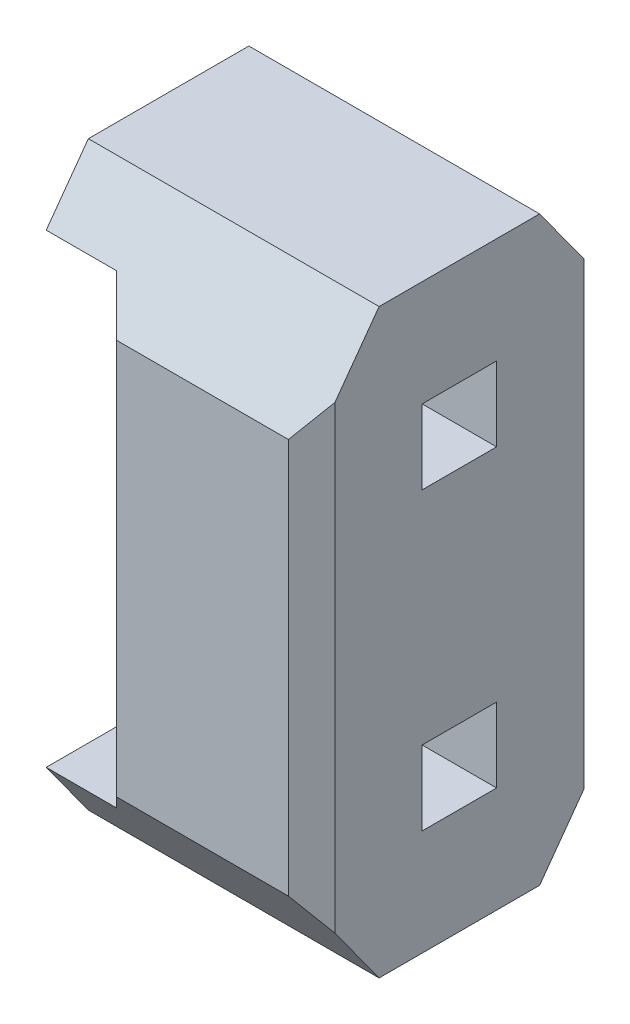
ISO-10303-21;
HEADER;
FILE_DESCRIPTION(('STEP AP214'),'2;1');
FILE_NAME('part.step','',(''),(''),'','','');
FILE_SCHEMA(('AUTOMOTIVE_DESIGN { 1 0 10303 214 1 1 1 1 }'));
ENDSEC;
DATA;
#1=APPLICATION_CONTEXT('core data for automotive mechanical design processes');
#2=APPLICATION_PROTOCOL_DEFINITION('international standard','automotive_design',2000,#1);
#3=PRODUCT_CONTEXT('',#1,'mechanical');
#4=PRODUCT('Part','Part','',(#3));
#5=PRODUCT_RELATED_PRODUCT_CATEGORY('part','',(#4));
#6=PRODUCT_DEFINITION_FORMATION('','',#4);
#7=PRODUCT_DEFINITION_CONTEXT('part definition',#1,'design');
#8=PRODUCT_DEFINITION('design','',#6,#7);
#9=PRODUCT_DEFINITION_SHAPE('','',#8);
#10=(LENGTH_UNIT() NAMED_UNIT(*) SI_UNIT(.MILLI.,.METRE.));
#11=(NAMED_UNIT(*) PLANE_ANGLE_UNIT() SI_UNIT($,.RADIAN.));
#12=(NAMED_UNIT(*) SI_UNIT($,.STERADIAN.) SOLID_ANGLE_UNIT());
#13=UNCERTAINTY_MEASURE_WITH_UNIT(LENGTH_MEASURE(1.E-05),#10,'distance_accuracy_value','');
#14=(GEOMETRIC_REPRESENTATION_CONTEXT(3) GLOBAL_UNCERTAINTY_ASSIGNED_CONTEXT((#13)) GLOBAL_UNIT_ASSIGNED_CONTEXT((#10,
#11,#12)) REPRESENTATION_CONTEXT('',''));
#15=CARTESIAN_POINT('',(0.,0.,0.));
#16=DIRECTION('',(0.,0.,1.));
#17=DIRECTION('',(1.,0.,0.));
#18=AXIS2_PLACEMENT_3D('',#15,#16,#17);
#19=CARTESIAN_POINT('',(1.25,4.6,-7.91));
#20=DIRECTION('',(0.,0.586967571460905,0.809610443394407));
#21=DIRECTION('',(0.,-0.809610443394407,0.586967571460905));
#22=AXIS2_PLACEMENT_3D('',#19,#20,#21);
#23=PLANE('',#22);
#24=DIRECTION('',(1.,0.,0.));
#25=VECTOR('',#24,1.);
#26=CARTESIAN_POINT('',(1.25,4.5,-7.8375));
#27=LINE('',#26,#25);
#28=CARTESIAN_POINT('',(0.,4.5,-7.8375));
#29=VERTEX_POINT('',#28);
#30=CARTESIAN_POINT('',(0.602500000000036,4.5,-7.83750000000004));
#31=VERTEX_POINT('',#30);
#32=EDGE_CURVE('E199',#29,#31,#27,.T.);
#33=ORIENTED_EDGE('',*,*,#32,.T.);
#34=DIRECTION('',(0.506207656349388,-0.698217457033654,0.506207656349365));
#35=VECTOR('',#34,1.);
#36=CARTESIAN_POINT('',(0.6025,4.5,-7.8375));
#37=LINE('',#36,#35);
#38=CARTESIAN_POINT('',(0.819999999999963,4.2,-7.61999999999997));
#39=VERTEX_POINT('',#38);
#40=EDGE_CURVE('E197',#31,#39,#37,.T.);
#41=ORIENTED_EDGE('',*,*,#40,.T.);
#42=DIRECTION('',(1.,0.,0.));
#43=VECTOR('',#42,1.);
#44=CARTESIAN_POINT('',(1.25,4.19999999999999,-7.62000000000001));
#45=LINE('',#44,#43);
#46=CARTESIAN_POINT('',(2.3,4.2,-7.62000000000001));
#47=VERTEX_POINT('',#46);
#48=EDGE_CURVE('E20',#39,#47,#45,.T.);
#49=ORIENTED_EDGE('',*,*,#48,.T.);
#50=DIRECTION('',(0.506207656348956,0.698217457033859,-0.506207656349515));
#51=VECTOR('',#50,1.);
#52=CARTESIAN_POINT('',(2.3,4.19999999999999,-7.62000000000001));
#53=LINE('',#52,#51);
#54=CARTESIAN_POINT('',(2.5,4.47586206896591,-7.82000000000012));
#55=VERTEX_POINT('',#54);
#56=EDGE_CURVE('E181',#47,#55,#53,.T.);
#57=ORIENTED_EDGE('',*,*,#56,.T.);
#58=DIRECTION('',(0.,-0.809610443394407,0.586967571460905));
#59=VECTOR('',#58,1.);
#60=CARTESIAN_POINT('',(2.5,4.6,-7.91));
#61=LINE('',#60,#59);
#62=CARTESIAN_POINT('',(2.5,5.,-8.19999999999999));
#63=VERTEX_POINT('',#62);
#64=EDGE_CURVE('E188',#55,#63,#61,.F.);
#65=ORIENTED_EDGE('',*,*,#64,.T.);
#66=DIRECTION('',(1.,0.,0.));
#67=VECTOR('',#66,1.);
#68=CARTESIAN_POINT('',(1.25,5.,-8.2));
#69=LINE('',#68,#67);
#70=CARTESIAN_POINT('',(0.,5.,-8.19999999999999));
#71=VERTEX_POINT('',#70);
#72=EDGE_CURVE('E215',#71,#63,#69,.T.);
#73=ORIENTED_EDGE('',*,*,#72,.F.);
#74=DIRECTION('',(0.,-0.809610443394407,0.586967571460905));
#75=VECTOR('',#74,1.);
#76=CARTESIAN_POINT('',(0.,4.6,-7.91));
#77=LINE('',#76,#75);
#78=EDGE_CURVE('E207',#71,#29,#77,.T.);
#79=ORIENTED_EDGE('',*,*,#78,.T.);
#80=EDGE_LOOP('',(#33,#41,#49,#57,#65,#73,#79));
#81=FACE_BOUND('',#80,.T.);
#82=ADVANCED_FACE('F17',(#81),#23,.T.);
#83=CARTESIAN_POINT('',(1.25,4.6,-9.87));
#84=DIRECTION('',(0.,-0.586967571460905,0.809610443394407));
#85=DIRECTION('',(0.,-0.809610443394407,-0.586967571460905));
#86=AXIS2_PLACEMENT_3D('',#83,#84,#85);
#87=PLANE('',#86);
#88=DIRECTION('',(0.,-0.809610443394407,-0.586967571460905));
#89=VECTOR('',#88,1.);
#90=CARTESIAN_POINT('',(0.,4.6,-9.87));
#91=LINE('',#90,#89);
#92=CARTESIAN_POINT('',(0.,5.,-9.58000000000001));
#93=VERTEX_POINT('',#92);
#94=CARTESIAN_POINT('',(0.,4.5,-9.9425));
#95=VERTEX_POINT('',#94);
#96=EDGE_CURVE('E263',#93,#95,#91,.T.);
#97=ORIENTED_EDGE('',*,*,#96,.F.);
#98=DIRECTION('',(1.,0.,0.));
#99=VECTOR('',#98,1.);
#100=CARTESIAN_POINT('',(1.25,5.,-9.58));
#101=LINE('',#100,#99);
#102=CARTESIAN_POINT('',(2.5,5.,-9.58));
#103=VERTEX_POINT('',#102);
#104=EDGE_CURVE('E227',#103,#93,#101,.F.);
#105=ORIENTED_EDGE('',*,*,#104,.F.);
#106=DIRECTION('',(0.,-0.809610443394407,-0.586967571460905));
#107=VECTOR('',#106,1.);
#108=CARTESIAN_POINT('',(2.5,4.6,-9.87));
#109=LINE('',#108,#107);
#110=CARTESIAN_POINT('',(2.49999999999994,4.47586206896591,-9.95999999999983));
#111=VERTEX_POINT('',#110);
#112=EDGE_CURVE('E223',#111,#103,#109,.F.);
#113=ORIENTED_EDGE('',*,*,#112,.F.);
#114=DIRECTION('',(0.506207656348956,0.698217457033859,0.506207656349515));
#115=VECTOR('',#114,1.);
#116=CARTESIAN_POINT('',(2.3,4.19999999999999,-10.16));
#117=LINE('',#116,#115);
#118=CARTESIAN_POINT('',(2.30000000000006,4.2,-10.1600000000001));
#119=VERTEX_POINT('',#118);
#120=EDGE_CURVE('E266',#119,#111,#117,.T.);
#121=ORIENTED_EDGE('',*,*,#120,.F.);
#122=DIRECTION('',(1.,0.,0.));
#123=VECTOR('',#122,1.);
#124=CARTESIAN_POINT('',(1.25,4.19999999999999,-10.16));
#125=LINE('',#124,#123);
#126=CARTESIAN_POINT('',(0.819999999999692,4.2,-10.1600000000001));
#127=VERTEX_POINT('',#126);
#128=EDGE_CURVE('E205',#127,#119,#125,.T.);
#129=ORIENTED_EDGE('',*,*,#128,.F.);
#130=DIRECTION('',(0.506207656349042,-0.698217457033819,-0.506207656349485));
#131=VECTOR('',#130,1.);
#132=CARTESIAN_POINT('',(0.6025,4.5,-9.9425));
#133=LINE('',#132,#131);
#134=CARTESIAN_POINT('',(0.602500000000055,4.5,-9.94249999999994));
#135=VERTEX_POINT('',#134);
#136=EDGE_CURVE('E203',#135,#127,#133,.T.);
#137=ORIENTED_EDGE('',*,*,#136,.F.);
#138=DIRECTION('',(1.,0.,0.));
#139=VECTOR('',#138,1.);
#140=CARTESIAN_POINT('',(1.25,4.5,-9.9425));
#141=LINE('',#140,#139);
#142=EDGE_CURVE('E261',#95,#135,#141,.T.);
#143=ORIENTED_EDGE('',*,*,#142,.F.);
#144=EDGE_LOOP('',(#97,#105,#113,#121,#129,#137,#143));
#145=FACE_BOUND('',#144,.T.);
#146=ADVANCED_FACE('F285',(#145),#87,.F.);
#147=CARTESIAN_POINT('',(1.25,0.4,-9.87));
#148=DIRECTION('',(0.,0.586967571460905,0.809610443394407));
#149=DIRECTION('',(0.,-0.809610443394407,0.586967571460905));
#150=AXIS2_PLACEMENT_3D('',#147,#148,#149);
#151=PLANE('',#150);
#152=DIRECTION('',(-0.506207656349403,0.698217457033647,-0.50620765634936));
#153=VECTOR('',#152,1.);
#154=CARTESIAN_POINT('',(2.5,0.524137931034498,-9.96));
#155=LINE('',#154,#153);
#156=CARTESIAN_POINT('',(2.49999999999994,0.524137931034499,-9.95999999999994));
#157=VERTEX_POINT('',#156);
#158=CARTESIAN_POINT('',(2.30000000000006,0.800000000000005,-10.1600000000001));
#159=VERTEX_POINT('',#158);
#160=EDGE_CURVE('E251',#157,#159,#155,.T.);
#161=ORIENTED_EDGE('',*,*,#160,.F.);
#162=DIRECTION('',(0.,-0.809610443394407,0.586967571460905));
#163=VECTOR('',#162,1.);
#164=CARTESIAN_POINT('',(2.5,0.4,-9.87));
#165=LINE('',#164,#163);
#166=CARTESIAN_POINT('',(2.5,0.,-9.58));
#167=VERTEX_POINT('',#166);
#168=EDGE_CURVE('E253',#167,#157,#165,.F.);
#169=ORIENTED_EDGE('',*,*,#168,.F.);
#170=DIRECTION('',(1.,0.,0.));
#171=VECTOR('',#170,1.);
#172=CARTESIAN_POINT('',(1.25,0.,-9.58));
#173=LINE('',#172,#171);
#174=CARTESIAN_POINT('',(0.,0.,-9.58000000000001));
#175=VERTEX_POINT('',#174);
#176=EDGE_CURVE('E288',#167,#175,#173,.F.);
#177=ORIENTED_EDGE('',*,*,#176,.T.);
#178=DIRECTION('',(0.,-0.809610443394407,0.586967571460905));
#179=VECTOR('',#178,1.);
#180=CARTESIAN_POINT('',(0.,0.4,-9.87));
#181=LINE('',#180,#179);
#182=CARTESIAN_POINT('',(0.,0.500000000000002,-9.9425));
#183=VERTEX_POINT('',#182);
#184=EDGE_CURVE('E255',#183,#175,#181,.T.);
#185=ORIENTED_EDGE('',*,*,#184,.F.);
#186=DIRECTION('',(1.,0.,0.));
#187=VECTOR('',#186,1.);
#188=CARTESIAN_POINT('',(1.25,0.500000000000004,-9.9425));
#189=LINE('',#188,#187);
#190=CARTESIAN_POINT('',(0.602500000000056,0.500000000000002,-9.94249999999994));
#191=VERTEX_POINT('',#190);
#192=EDGE_CURVE('E257',#191,#183,#189,.F.);
#193=ORIENTED_EDGE('',*,*,#192,.F.);
#194=DIRECTION('',(-0.506207656349042,-0.698217457033819,0.506207656349485));
#195=VECTOR('',#194,1.);
#196=CARTESIAN_POINT('',(0.8199999999998,0.800000000000011,-10.16));
#197=LINE('',#196,#195);
#198=CARTESIAN_POINT('',(0.819999999999692,0.800000000000005,-10.1600000000001));
#199=VERTEX_POINT('',#198);
#200=EDGE_CURVE('E259',#199,#191,#197,.T.);
#201=ORIENTED_EDGE('',*,*,#200,.F.);
#202=DIRECTION('',(1.,0.,0.));
#203=VECTOR('',#202,1.);
#204=CARTESIAN_POINT('',(1.25,0.800000000000011,-10.16));
#205=LINE('',#204,#203);
#206=EDGE_CURVE('E249',#159,#199,#205,.F.);
#207=ORIENTED_EDGE('',*,*,#206,.F.);
#208=EDGE_LOOP('',(#161,#169,#177,#185,#193,#201,#207));
#209=FACE_BOUND('',#208,.T.);
#210=ADVANCED_FACE('F431',(#209),#151,.F.);
#211=CARTESIAN_POINT('',(1.25,0.4,-7.91));
#212=DIRECTION('',(0.,-0.586967571460905,0.809610443394407));
#213=DIRECTION('',(0.,-0.809610443394407,-0.586967571460905));
#214=AXIS2_PLACEMENT_3D('',#211,#212,#213);
#215=PLANE('',#214);
#216=DIRECTION('',(1.,0.,0.));
#217=VECTOR('',#216,1.);
#218=CARTESIAN_POINT('',(1.25,0.80000000000001,-7.62000000000001));
#219=LINE('',#218,#217);
#220=CARTESIAN_POINT('',(2.3,0.800000000000005,-7.62000000000001));
#221=VERTEX_POINT('',#220);
#222=CARTESIAN_POINT('',(0.819999999999963,0.800000000000005,-7.61999999999997));
#223=VERTEX_POINT('',#222);
#224=EDGE_CURVE('E191',#221,#223,#219,.F.);
#225=ORIENTED_EDGE('',*,*,#224,.T.);
#226=DIRECTION('',(-0.506207656349386,-0.698217457033655,-0.506207656349366));
#227=VECTOR('',#226,1.);
#228=CARTESIAN_POINT('',(0.82,0.80000000000001,-7.62000000000001));
#229=LINE('',#228,#227);
#230=CARTESIAN_POINT('',(0.602500000000036,0.500000000000001,-7.83750000000004));
#231=VERTEX_POINT('',#230);
#232=EDGE_CURVE('E232',#223,#231,#229,.T.);
#233=ORIENTED_EDGE('',*,*,#232,.T.);
#234=DIRECTION('',(1.,0.,0.));
#235=VECTOR('',#234,1.);
#236=CARTESIAN_POINT('',(1.25,0.500000000000002,-7.8375));
#237=LINE('',#236,#235);
#238=CARTESIAN_POINT('',(0.,0.500000000000001,-7.8375));
#239=VERTEX_POINT('',#238);
#240=EDGE_CURVE('E246',#231,#239,#237,.F.);
#241=ORIENTED_EDGE('',*,*,#240,.T.);
#242=DIRECTION('',(0.,-0.809610443394407,-0.586967571460905));
#243=VECTOR('',#242,1.);
#244=CARTESIAN_POINT('',(0.,0.4,-7.91));
#245=LINE('',#244,#243);
#246=CARTESIAN_POINT('',(0.,0.,-8.19999999999999));
#247=VERTEX_POINT('',#246);
#248=EDGE_CURVE('E244',#239,#247,#245,.T.);
#249=ORIENTED_EDGE('',*,*,#248,.T.);
#250=DIRECTION('',(1.,0.,0.));
#251=VECTOR('',#250,1.);
#252=CARTESIAN_POINT('',(1.25,0.,-8.2));
#253=LINE('',#252,#251);
#254=CARTESIAN_POINT('',(2.5,0.,-8.2));
#255=VERTEX_POINT('',#254);
#256=EDGE_CURVE('E293',#247,#255,#253,.T.);
#257=ORIENTED_EDGE('',*,*,#256,.T.);
#258=DIRECTION('',(0.,-0.809610443394407,-0.586967571460905));
#259=VECTOR('',#258,1.);
#260=CARTESIAN_POINT('',(2.5,0.4,-7.91));
#261=LINE('',#260,#259);
#262=CARTESIAN_POINT('',(2.5,0.524137931034498,-7.82));
#263=VERTEX_POINT('',#262);
#264=EDGE_CURVE('E241',#255,#263,#261,.F.);
#265=ORIENTED_EDGE('',*,*,#264,.T.);
#266=DIRECTION('',(-0.506207656349402,0.698217457033647,0.506207656349361));
#267=VECTOR('',#266,1.);
#268=CARTESIAN_POINT('',(2.5,0.524137931034496,-7.82));
#269=LINE('',#268,#267);
#270=EDGE_CURVE('E239',#263,#221,#269,.T.);
#271=ORIENTED_EDGE('',*,*,#270,.T.);
#272=EDGE_LOOP('',(#225,#233,#241,#249,#257,#265,#271));
#273=FACE_BOUND('',#272,.T.);
#274=ADVANCED_FACE('F421',(#273),#215,.T.);
#275=CARTESIAN_POINT('',(1.25,5.,-8.89));
#276=DIRECTION('',(0.,1.,0.));
#277=DIRECTION('',(0.,0.,1.));
#278=AXIS2_PLACEMENT_3D('',#275,#276,#277);
#279=PLANE('',#278);
#280=ORIENTED_EDGE('',*,*,#104,.T.);
#281=DIRECTION('',(0.,0.,-1.));
#282=VECTOR('',#281,1.);
#283=CARTESIAN_POINT('',(0.,5.,-8.89));
#284=LINE('',#283,#282);
#285=EDGE_CURVE('E231',#93,#71,#284,.F.);
#286=ORIENTED_EDGE('',*,*,#285,.T.);
#287=ORIENTED_EDGE('',*,*,#72,.T.);
#288=DIRECTION('',(0.,0.,1.));
#289=VECTOR('',#288,1.);
#290=CARTESIAN_POINT('',(2.5,5.,-8.89));
#291=LINE('',#290,#289);
#292=EDGE_CURVE('E219',#63,#103,#291,.F.);
#293=ORIENTED_EDGE('',*,*,#292,.T.);
#294=EDGE_LOOP('',(#280,#286,#287,#293));
#295=FACE_BOUND('',#294,.T.);
#296=ADVANCED_FACE('F229',(#295),#279,.T.);
#297=CARTESIAN_POINT('',(1.25,0.,-8.89));
#298=DIRECTION('',(0.,1.,0.));
#299=DIRECTION('',(0.,0.,1.));
#300=AXIS2_PLACEMENT_3D('',#297,#298,#299);
#301=PLANE('',#300);
#302=DIRECTION('',(0.,0.,-1.));
#303=VECTOR('',#302,1.);
#304=CARTESIAN_POINT('',(0.,0.,-8.89));
#305=LINE('',#304,#303);
#306=EDGE_CURVE('E297',#247,#175,#305,.T.);
#307=ORIENTED_EDGE('',*,*,#306,.T.);
#308=ORIENTED_EDGE('',*,*,#176,.F.);
#309=DIRECTION('',(0.,0.,1.));
#310=VECTOR('',#309,1.);
#311=CARTESIAN_POINT('',(2.5,0.,-8.89));
#312=LINE('',#311,#310);
#313=EDGE_CURVE('E287',#255,#167,#312,.F.);
#314=ORIENTED_EDGE('',*,*,#313,.F.);
#315=ORIENTED_EDGE('',*,*,#256,.F.);
#316=EDGE_LOOP('',(#307,#308,#314,#315));
#317=FACE_BOUND('',#316,.T.);
#318=ADVANCED_FACE('F428',(#317),#301,.F.);
#319=CARTESIAN_POINT('',(0.,4.75,-8.89));
#320=DIRECTION('',(1.,0.,0.));
#321=DIRECTION('',(0.,0.,-1.));
#322=AXIS2_PLACEMENT_3D('',#319,#320,#321);
#323=PLANE('',#322);
#324=ORIENTED_EDGE('',*,*,#285,.F.);
#325=ORIENTED_EDGE('',*,*,#96,.T.);
#326=DIRECTION('',(0.,0.,1.));
#327=VECTOR('',#326,1.);
#328=CARTESIAN_POINT('',(0.,4.5,-8.89));
#329=LINE('',#328,#327);
#330=EDGE_CURVE('E307',#95,#29,#329,.T.);
#331=ORIENTED_EDGE('',*,*,#330,.T.);
#332=ORIENTED_EDGE('',*,*,#78,.F.);
#333=EDGE_LOOP('',(#324,#325,#331,#332));
#334=FACE_BOUND('',#333,.T.);
#335=ADVANCED_FACE('F441',(#334),#323,.F.);
#336=CARTESIAN_POINT('',(0.,0.25,-8.89));
#337=DIRECTION('',(1.,0.,0.));
#338=DIRECTION('',(0.,0.,-1.));
#339=AXIS2_PLACEMENT_3D('',#336,#337,#338);
#340=PLANE('',#339);
#341=ORIENTED_EDGE('',*,*,#306,.F.);
#342=ORIENTED_EDGE('',*,*,#248,.F.);
#343=DIRECTION('',(0.,0.,1.));
#344=VECTOR('',#343,1.);
#345=CARTESIAN_POINT('',(0.,0.5,-8.89));
#346=LINE('',#345,#344);
#347=EDGE_CURVE('E315',#183,#239,#346,.T.);
#348=ORIENTED_EDGE('',*,*,#347,.F.);
#349=ORIENTED_EDGE('',*,*,#184,.T.);
#350=EDGE_LOOP('',(#341,#342,#348,#349));
#351=FACE_BOUND('',#350,.T.);
#352=ADVANCED_FACE('F443',(#351),#340,.F.);
#353=CARTESIAN_POINT('',(1.55,3.45,-8.89));
#354=DIRECTION('',(0.,1.,0.));
#355=DIRECTION('',(0.,0.,1.));
#356=AXIS2_PLACEMENT_3D('',#353,#354,#355);
#357=PLANE('',#356);
#358=DIRECTION('',(1.,0.,0.));
#359=VECTOR('',#358,1.);
#360=CARTESIAN_POINT('',(1.55,3.45,-9.21));
#361=LINE('',#360,#359);
#362=CARTESIAN_POINT('',(0.6,3.45,-9.21));
#363=VERTEX_POINT('',#362);
#364=CARTESIAN_POINT('',(2.5,3.45,-9.21));
#365=VERTEX_POINT('',#364);
#366=EDGE_CURVE('E332',#363,#365,#361,.T.);
#367=ORIENTED_EDGE('',*,*,#366,.F.);
#368=DIRECTION('',(0.,0.,1.));
#369=VECTOR('',#368,1.);
#370=CARTESIAN_POINT('',(0.6,3.45,-8.89));
#371=LINE('',#370,#369);
#372=CARTESIAN_POINT('',(0.6,3.45,-8.57));
#373=VERTEX_POINT('',#372);
#374=EDGE_CURVE('E302',#363,#373,#371,.T.);
#375=ORIENTED_EDGE('',*,*,#374,.T.);
#376=DIRECTION('',(1.,0.,0.));
#377=VECTOR('',#376,1.);
#378=CARTESIAN_POINT('',(1.55,3.45,-8.57));
#379=LINE('',#378,#377);
#380=CARTESIAN_POINT('',(2.5,3.45,-8.57));
#381=VERTEX_POINT('',#380);
#382=EDGE_CURVE('E327',#373,#381,#379,.T.);
#383=ORIENTED_EDGE('',*,*,#382,.T.);
#384=DIRECTION('',(0.,0.,1.));
#385=VECTOR('',#384,1.);
#386=CARTESIAN_POINT('',(2.5,3.45,-8.89));
#387=LINE('',#386,#385);
#388=EDGE_CURVE('E300',#381,#365,#387,.F.);
#389=ORIENTED_EDGE('',*,*,#388,.T.);
#390=EDGE_LOOP('',(#367,#375,#383,#389));
#391=FACE_BOUND('',#390,.T.);
#392=ADVANCED_FACE('F398',(#391),#357,.T.);
#393=CARTESIAN_POINT('',(0.7099999999997,2.5,-10.05));
#394=DIRECTION('',(0.707106781188998,0.,0.707106781184098));
#395=DIRECTION('',(0.707106781184098,0.,-0.707106781188998));
#396=AXIS2_PLACEMENT_3D('',#393,#394,#395);
#397=PLANE('',#396);
#398=ORIENTED_EDGE('',*,*,#200,.T.);
#399=DIRECTION('',(0.70710678118621,0.,-0.707106781186885));
#400=VECTOR('',#399,1.);
#401=CARTESIAN_POINT('',(0.6,0.5,-9.94));
#402=LINE('',#401,#400);
#403=CARTESIAN_POINT('',(0.600000000000115,0.5,-9.93999999999988));
#404=VERTEX_POINT('',#403);
#405=EDGE_CURVE('E312',#404,#191,#402,.T.);
#406=ORIENTED_EDGE('',*,*,#405,.F.);
#407=DIRECTION('',(0.,1.,0.));
#408=VECTOR('',#407,1.);
#409=CARTESIAN_POINT('',(0.6,2.5,-9.94));
#410=LINE('',#409,#408);
#411=CARTESIAN_POINT('',(0.600000000000115,4.5,-9.93999999999988));
#412=VERTEX_POINT('',#411);
#413=EDGE_CURVE('E337',#404,#412,#410,.T.);
#414=ORIENTED_EDGE('',*,*,#413,.T.);
#415=DIRECTION('',(0.70710678118621,0.,-0.707106781186885));
#416=VECTOR('',#415,1.);
#417=CARTESIAN_POINT('',(0.6,4.5,-9.94));
#418=LINE('',#417,#416);
#419=EDGE_CURVE('E304',#412,#135,#418,.T.);
#420=ORIENTED_EDGE('',*,*,#419,.T.);
#421=ORIENTED_EDGE('',*,*,#136,.T.);
#422=DIRECTION('',(0.,1.,0.));
#423=VECTOR('',#422,1.);
#424=CARTESIAN_POINT('',(0.8199999999998,2.5,-10.16));
#425=LINE('',#424,#423);
#426=EDGE_CURVE('E275',#127,#199,#425,.F.);
#427=ORIENTED_EDGE('',*,*,#426,.T.);
#428=EDGE_LOOP('',(#398,#406,#414,#420,#421,#427));
#429=FACE_BOUND('',#428,.T.);
#430=ADVANCED_FACE('F435',(#429),#397,.F.);
#431=CARTESIAN_POINT('',(0.30125,4.5,-8.89));
#432=DIRECTION('',(0.,1.,0.));
#433=DIRECTION('',(0.,0.,1.));
#434=AXIS2_PLACEMENT_3D('',#431,#432,#433);
#435=PLANE('',#434);
#436=ORIENTED_EDGE('',*,*,#142,.T.);
#437=ORIENTED_EDGE('',*,*,#419,.F.);
#438=DIRECTION('',(0.,0.,-1.));
#439=VECTOR('',#438,1.);
#440=CARTESIAN_POINT('',(0.6,4.5,-8.89));
#441=LINE('',#440,#439);
#442=CARTESIAN_POINT('',(0.600000000000037,4.5,-7.84000000000004));
#443=VERTEX_POINT('',#442);
#444=EDGE_CURVE('E339',#412,#443,#441,.F.);
#445=ORIENTED_EDGE('',*,*,#444,.T.);
#446=DIRECTION('',(-0.707106781185598,0.,-0.707106781187498));
#447=VECTOR('',#446,1.);
#448=CARTESIAN_POINT('',(0.71,4.5,-7.73));
#449=LINE('',#448,#447);
#450=EDGE_CURVE('E310',#443,#31,#449,.F.);
#451=ORIENTED_EDGE('',*,*,#450,.T.);
#452=ORIENTED_EDGE('',*,*,#32,.F.);
#453=ORIENTED_EDGE('',*,*,#330,.F.);
#454=EDGE_LOOP('',(#436,#437,#445,#451,#452,#453));
#455=FACE_BOUND('',#454,.T.);
#456=ADVANCED_FACE('F439',(#455),#435,.F.);
#457=CARTESIAN_POINT('',(0.71,2.5,-7.73));
#458=DIRECTION('',(0.707106781187498,0.,-0.707106781185598));
#459=DIRECTION('',(-0.707106781185598,0.,-0.707106781187498));
#460=AXIS2_PLACEMENT_3D('',#457,#458,#459);
#461=PLANE('',#460);
#462=ORIENTED_EDGE('',*,*,#232,.F.);
#463=DIRECTION('',(0.,1.,0.));
#464=VECTOR('',#463,1.);
#465=CARTESIAN_POINT('',(0.82,2.5,-7.62));
#466=LINE('',#465,#464);
#467=EDGE_CURVE('E325',#39,#223,#466,.F.);
#468=ORIENTED_EDGE('',*,*,#467,.F.);
#469=ORIENTED_EDGE('',*,*,#40,.F.);
#470=ORIENTED_EDGE('',*,*,#450,.F.);
#471=DIRECTION('',(0.,1.,0.));
#472=VECTOR('',#471,1.);
#473=CARTESIAN_POINT('',(0.6,2.5,-7.84));
#474=LINE('',#473,#472);
#475=CARTESIAN_POINT('',(0.600000000000074,0.5,-7.84000000000007));
#476=VERTEX_POINT('',#475);
#477=EDGE_CURVE('E341',#443,#476,#474,.F.);
#478=ORIENTED_EDGE('',*,*,#477,.T.);
#479=DIRECTION('',(-0.707106781186701,0.,-0.707106781186394));
#480=VECTOR('',#479,1.);
#481=CARTESIAN_POINT('',(0.6025,0.5,-7.8375));
#482=LINE('',#481,#480);
#483=EDGE_CURVE('E318',#231,#476,#482,.T.);
#484=ORIENTED_EDGE('',*,*,#483,.F.);
#485=EDGE_LOOP('',(#462,#468,#469,#470,#478,#484));
#486=FACE_BOUND('',#485,.T.);
#487=ADVANCED_FACE('F416',(#486),#461,.F.);
#488=CARTESIAN_POINT('',(0.30125,0.5,-8.89));
#489=DIRECTION('',(0.,1.,0.));
#490=DIRECTION('',(0.,0.,1.));
#491=AXIS2_PLACEMENT_3D('',#488,#489,#490);
#492=PLANE('',#491);
#493=ORIENTED_EDGE('',*,*,#483,.T.);
#494=DIRECTION('',(0.,0.,-1.));
#495=VECTOR('',#494,1.);
#496=CARTESIAN_POINT('',(0.6,0.5,-8.89));
#497=LINE('',#496,#495);
#498=EDGE_CURVE('E343',#476,#404,#497,.T.);
#499=ORIENTED_EDGE('',*,*,#498,.T.);
#500=ORIENTED_EDGE('',*,*,#405,.T.);
#501=ORIENTED_EDGE('',*,*,#192,.T.);
#502=ORIENTED_EDGE('',*,*,#347,.T.);
#503=ORIENTED_EDGE('',*,*,#240,.F.);
#504=EDGE_LOOP('',(#493,#499,#500,#501,#502,#503));
#505=FACE_BOUND('',#504,.T.);
#506=ADVANCED_FACE('F418',(#505),#492,.T.);
#507=CARTESIAN_POINT('',(1.55,1.23,-9.21));
#508=DIRECTION('',(0.,0.,1.));
#509=DIRECTION('',(1.,0.,0.));
#510=AXIS2_PLACEMENT_3D('',#507,#508,#509);
#511=PLANE('',#510);
#512=DIRECTION('',(1.,0.,0.));
#513=VECTOR('',#512,1.);
#514=CARTESIAN_POINT('',(1.55,1.55,-9.21));
#515=LINE('',#514,#513);
#516=CARTESIAN_POINT('',(2.5,1.55,-9.21));
#517=VERTEX_POINT('',#516);
#518=CARTESIAN_POINT('',(0.6,1.55,-9.21));
#519=VERTEX_POINT('',#518);
#520=EDGE_CURVE('E283',#517,#519,#515,.F.);
#521=ORIENTED_EDGE('',*,*,#520,.T.);
#522=DIRECTION('',(0.,1.,0.));
#523=VECTOR('',#522,1.);
#524=CARTESIAN_POINT('',(0.6,2.5,-9.21));
#525=LINE('',#524,#523);
#526=CARTESIAN_POINT('',(0.6,0.91,-9.21));
#527=VERTEX_POINT('',#526);
#528=EDGE_CURVE('E346',#519,#527,#525,.F.);
#529=ORIENTED_EDGE('',*,*,#528,.T.);
#530=DIRECTION('',(1.,0.,0.));
#531=VECTOR('',#530,1.);
#532=CARTESIAN_POINT('',(1.55,0.91,-9.21));
#533=LINE('',#532,#531);
#534=CARTESIAN_POINT('',(2.5,0.91,-9.21));
#535=VERTEX_POINT('',#534);
#536=EDGE_CURVE('E354',#535,#527,#533,.F.);
#537=ORIENTED_EDGE('',*,*,#536,.F.);
#538=DIRECTION('',(0.,1.,0.));
#539=VECTOR('',#538,1.);
#540=CARTESIAN_POINT('',(2.5,1.23,-9.21));
#541=LINE('',#540,#539);
#542=EDGE_CURVE('E321',#535,#517,#541,.T.);
#543=ORIENTED_EDGE('',*,*,#542,.T.);
#544=EDGE_LOOP('',(#521,#529,#537,#543));
#545=FACE_BOUND('',#544,.T.);
#546=ADVANCED_FACE('F483',(#545),#511,.T.);
#547=CARTESIAN_POINT('',(1.56,2.5,-10.16));
#548=DIRECTION('',(0.,0.,1.));
#549=DIRECTION('',(1.,0.,0.));
#550=AXIS2_PLACEMENT_3D('',#547,#548,#549);
#551=PLANE('',#550);
#552=DIRECTION('',(0.,1.,0.));
#553=VECTOR('',#552,1.);
#554=CARTESIAN_POINT('',(2.30000000000023,2.5,-10.1600000000002));
#555=LINE('',#554,#553);
#556=EDGE_CURVE('E193',#159,#119,#555,.T.);
#557=ORIENTED_EDGE('',*,*,#556,.F.);
#558=ORIENTED_EDGE('',*,*,#206,.T.);
#559=ORIENTED_EDGE('',*,*,#426,.F.);
#560=ORIENTED_EDGE('',*,*,#128,.T.);
#561=EDGE_LOOP('',(#557,#558,#559,#560));
#562=FACE_BOUND('',#561,.T.);
#563=ADVANCED_FACE('F272',(#562),#551,.F.);
#564=CARTESIAN_POINT('',(1.56,2.5,-7.62));
#565=DIRECTION('',(0.,0.,1.));
#566=DIRECTION('',(1.,0.,0.));
#567=AXIS2_PLACEMENT_3D('',#564,#565,#566);
#568=PLANE('',#567);
#569=ORIENTED_EDGE('',*,*,#48,.F.);
#570=ORIENTED_EDGE('',*,*,#467,.T.);
#571=ORIENTED_EDGE('',*,*,#224,.F.);
#572=DIRECTION('',(0.,1.,0.));
#573=VECTOR('',#572,1.);
#574=CARTESIAN_POINT('',(2.3,2.5,-7.62));
#575=LINE('',#574,#573);
#576=EDGE_CURVE('E183',#47,#221,#575,.F.);
#577=ORIENTED_EDGE('',*,*,#576,.F.);
#578=EDGE_LOOP('',(#569,#570,#571,#577));
#579=FACE_BOUND('',#578,.T.);
#580=ADVANCED_FACE('F189',(#579),#568,.T.);
#581=CARTESIAN_POINT('',(1.55,3.77,-8.57));
#582=DIRECTION('',(0.,0.,1.));
#583=DIRECTION('',(1.,0.,0.));
#584=AXIS2_PLACEMENT_3D('',#581,#582,#583);
#585=PLANE('',#584);
#586=DIRECTION('',(0.,1.,0.));
#587=VECTOR('',#586,1.);
#588=CARTESIAN_POINT('',(2.5,3.77,-8.57));
#589=LINE('',#588,#587);
#590=CARTESIAN_POINT('',(2.5,4.09,-8.57));
#591=VERTEX_POINT('',#590);
#592=EDGE_CURVE('E330',#381,#591,#589,.T.);
#593=ORIENTED_EDGE('',*,*,#592,.F.);
#594=ORIENTED_EDGE('',*,*,#382,.F.);
#595=DIRECTION('',(0.,1.,0.));
#596=VECTOR('',#595,1.);
#597=CARTESIAN_POINT('',(0.6,2.5,-8.57));
#598=LINE('',#597,#596);
#599=CARTESIAN_POINT('',(0.6,4.09,-8.57));
#600=VERTEX_POINT('',#599);
#601=EDGE_CURVE('E351',#373,#600,#598,.T.);
#602=ORIENTED_EDGE('',*,*,#601,.T.);
#603=DIRECTION('',(1.,0.,0.));
#604=VECTOR('',#603,1.);
#605=CARTESIAN_POINT('',(1.55,4.09,-8.57));
#606=LINE('',#605,#604);
#607=EDGE_CURVE('E368',#600,#591,#606,.T.);
#608=ORIENTED_EDGE('',*,*,#607,.T.);
#609=EDGE_LOOP('',(#593,#594,#602,#608));
#610=FACE_BOUND('',#609,.T.);
#611=ADVANCED_FACE('F402',(#610),#585,.F.);
#612=CARTESIAN_POINT('',(1.55,3.77,-9.21));
#613=DIRECTION('',(0.,0.,1.));
#614=DIRECTION('',(1.,0.,0.));
#615=AXIS2_PLACEMENT_3D('',#612,#613,#614);
#616=PLANE('',#615);
#617=DIRECTION('',(1.,0.,0.));
#618=VECTOR('',#617,1.);
#619=CARTESIAN_POINT('',(1.55,4.09,-9.21));
#620=LINE('',#619,#618);
#621=CARTESIAN_POINT('',(2.5,4.09,-9.21));
#622=VERTEX_POINT('',#621);
#623=CARTESIAN_POINT('',(0.6,4.09,-9.21));
#624=VERTEX_POINT('',#623);
#625=EDGE_CURVE('E371',#622,#624,#620,.F.);
#626=ORIENTED_EDGE('',*,*,#625,.T.);
#627=DIRECTION('',(0.,1.,0.));
#628=VECTOR('',#627,1.);
#629=CARTESIAN_POINT('',(0.6,2.5,-9.21));
#630=LINE('',#629,#628);
#631=EDGE_CURVE('E348',#624,#363,#630,.F.);
#632=ORIENTED_EDGE('',*,*,#631,.T.);
#633=ORIENTED_EDGE('',*,*,#366,.T.);
#634=DIRECTION('',(0.,1.,0.));
#635=VECTOR('',#634,1.);
#636=CARTESIAN_POINT('',(2.5,3.77,-9.21));
#637=LINE('',#636,#635);
#638=EDGE_CURVE('E335',#365,#622,#637,.T.);
#639=ORIENTED_EDGE('',*,*,#638,.T.);
#640=EDGE_LOOP('',(#626,#632,#633,#639));
#641=FACE_BOUND('',#640,.T.);
#642=ADVANCED_FACE('F395',(#641),#616,.T.);
#643=CARTESIAN_POINT('',(0.6,2.5,-8.89));
#644=DIRECTION('',(1.,0.,0.));
#645=DIRECTION('',(0.,0.,-1.));
#646=AXIS2_PLACEMENT_3D('',#643,#644,#645);
#647=PLANE('',#646);
#648=ORIENTED_EDGE('',*,*,#374,.F.);
#649=ORIENTED_EDGE('',*,*,#631,.F.);
#650=DIRECTION('',(0.,0.,1.));
#651=VECTOR('',#650,1.);
#652=CARTESIAN_POINT('',(0.6,4.09,-8.89));
#653=LINE('',#652,#651);
#654=EDGE_CURVE('E192',#624,#600,#653,.T.);
#655=ORIENTED_EDGE('',*,*,#654,.T.);
#656=ORIENTED_EDGE('',*,*,#601,.F.);
#657=EDGE_LOOP('',(#648,#649,#655,#656));
#658=FACE_BOUND('',#657,.T.);
#659=ORIENTED_EDGE('',*,*,#528,.F.);
#660=DIRECTION('',(0.,0.,1.));
#661=VECTOR('',#660,1.);
#662=CARTESIAN_POINT('',(0.6,1.55,-8.89));
#663=LINE('',#662,#661);
#664=CARTESIAN_POINT('',(0.6,1.55,-8.57));
#665=VERTEX_POINT('',#664);
#666=EDGE_CURVE('E360',#519,#665,#663,.T.);
#667=ORIENTED_EDGE('',*,*,#666,.T.);
#668=DIRECTION('',(0.,1.,0.));
#669=VECTOR('',#668,1.);
#670=CARTESIAN_POINT('',(0.6,1.23,-8.57));
#671=LINE('',#670,#669);
#672=CARTESIAN_POINT('',(0.6,0.91,-8.57));
#673=VERTEX_POINT('',#672);
#674=EDGE_CURVE('E374',#665,#673,#671,.F.);
#675=ORIENTED_EDGE('',*,*,#674,.T.);
#676=DIRECTION('',(0.,0.,1.));
#677=VECTOR('',#676,1.);
#678=CARTESIAN_POINT('',(0.6,0.91,-8.89));
#679=LINE('',#678,#677);
#680=EDGE_CURVE('E357',#527,#673,#679,.T.);
#681=ORIENTED_EDGE('',*,*,#680,.F.);
#682=EDGE_LOOP('',(#659,#667,#675,#681));
#683=FACE_BOUND('',#682,.T.);
#684=ORIENTED_EDGE('',*,*,#477,.F.);
#685=ORIENTED_EDGE('',*,*,#444,.F.);
#686=ORIENTED_EDGE('',*,*,#413,.F.);
#687=ORIENTED_EDGE('',*,*,#498,.F.);
#688=EDGE_LOOP('',(#684,#685,#686,#687));
#689=FACE_BOUND('',#688,.T.);
#690=ADVANCED_FACE('F404',(#658,#683,#689),#647,.F.);
#691=CARTESIAN_POINT('',(1.55,0.91,-8.89));
#692=DIRECTION('',(0.,1.,0.));
#693=DIRECTION('',(0.,0.,1.));
#694=AXIS2_PLACEMENT_3D('',#691,#692,#693);
#695=PLANE('',#694);
#696=ORIENTED_EDGE('',*,*,#536,.T.);
#697=ORIENTED_EDGE('',*,*,#680,.T.);
#698=DIRECTION('',(1.,0.,0.));
#699=VECTOR('',#698,1.);
#700=CARTESIAN_POINT('',(1.55,0.91,-8.57));
#701=LINE('',#700,#699);
#702=CARTESIAN_POINT('',(2.5,0.91,-8.57));
#703=VERTEX_POINT('',#702);
#704=EDGE_CURVE('E376',#673,#703,#701,.T.);
#705=ORIENTED_EDGE('',*,*,#704,.T.);
#706=DIRECTION('',(0.,0.,1.));
#707=VECTOR('',#706,1.);
#708=CARTESIAN_POINT('',(2.5,0.91,-8.89));
#709=LINE('',#708,#707);
#710=EDGE_CURVE('E34',#703,#535,#709,.F.);
#711=ORIENTED_EDGE('',*,*,#710,.T.);
#712=EDGE_LOOP('',(#696,#697,#705,#711));
#713=FACE_BOUND('',#712,.T.);
#714=ADVANCED_FACE('F407',(#713),#695,.T.);
#715=CARTESIAN_POINT('',(1.55,1.55,-8.89));
#716=DIRECTION('',(0.,1.,0.));
#717=DIRECTION('',(0.,0.,1.));
#718=AXIS2_PLACEMENT_3D('',#715,#716,#717);
#719=PLANE('',#718);
#720=DIRECTION('',(0.,0.,1.));
#721=VECTOR('',#720,1.);
#722=CARTESIAN_POINT('',(2.5,1.55,-8.89));
#723=LINE('',#722,#721);
#724=CARTESIAN_POINT('',(2.5,1.55,-8.57));
#725=VERTEX_POINT('',#724);
#726=EDGE_CURVE('E362',#725,#517,#723,.F.);
#727=ORIENTED_EDGE('',*,*,#726,.F.);
#728=DIRECTION('',(1.,0.,0.));
#729=VECTOR('',#728,1.);
#730=CARTESIAN_POINT('',(1.55,1.55,-8.57));
#731=LINE('',#730,#729);
#732=EDGE_CURVE('E378',#725,#665,#731,.F.);
#733=ORIENTED_EDGE('',*,*,#732,.T.);
#734=ORIENTED_EDGE('',*,*,#666,.F.);
#735=ORIENTED_EDGE('',*,*,#520,.F.);
#736=EDGE_LOOP('',(#727,#733,#734,#735));
#737=FACE_BOUND('',#736,.T.);
#738=ADVANCED_FACE('F468',(#737),#719,.F.);
#739=CARTESIAN_POINT('',(2.4,2.5,-10.06));
#740=DIRECTION('',(0.707106781188198,0.,-0.707106781184898));
#741=DIRECTION('',(-0.707106781184898,0.,-0.707106781188198));
#742=AXIS2_PLACEMENT_3D('',#739,#740,#741);
#743=PLANE('',#742);
#744=DIRECTION('',(0.,1.,0.));
#745=VECTOR('',#744,1.);
#746=CARTESIAN_POINT('',(2.5,2.5,-9.96));
#747=LINE('',#746,#745);
#748=EDGE_CURVE('E381',#157,#111,#747,.T.);
#749=ORIENTED_EDGE('',*,*,#748,.F.);
#750=ORIENTED_EDGE('',*,*,#160,.T.);
#751=ORIENTED_EDGE('',*,*,#556,.T.);
#752=ORIENTED_EDGE('',*,*,#120,.T.);
#753=EDGE_LOOP('',(#749,#750,#751,#752));
#754=FACE_BOUND('',#753,.T.);
#755=ADVANCED_FACE('F281',(#754),#743,.T.);
#756=CARTESIAN_POINT('',(2.4,2.5,-7.72));
#757=DIRECTION('',(0.707106781186548,0.,0.707106781186548));
#758=DIRECTION('',(0.707106781186548,0.,-0.707106781186548));
#759=AXIS2_PLACEMENT_3D('',#756,#757,#758);
#760=PLANE('',#759);
#761=DIRECTION('',(0.,1.,0.));
#762=VECTOR('',#761,1.);
#763=CARTESIAN_POINT('',(2.5,2.5,-7.82));
#764=LINE('',#763,#762);
#765=EDGE_CURVE('E186',#55,#263,#764,.F.);
#766=ORIENTED_EDGE('',*,*,#765,.F.);
#767=ORIENTED_EDGE('',*,*,#56,.F.);
#768=ORIENTED_EDGE('',*,*,#576,.T.);
#769=ORIENTED_EDGE('',*,*,#270,.F.);
#770=EDGE_LOOP('',(#766,#767,#768,#769));
#771=FACE_BOUND('',#770,.T.);
#772=ADVANCED_FACE('F182',(#771),#760,.T.);
#773=CARTESIAN_POINT('',(1.55,4.09,-8.89));
#774=DIRECTION('',(0.,1.,0.));
#775=DIRECTION('',(0.,0.,1.));
#776=AXIS2_PLACEMENT_3D('',#773,#774,#775);
#777=PLANE('',#776);
#778=DIRECTION('',(0.,0.,-1.));
#779=VECTOR('',#778,1.);
#780=CARTESIAN_POINT('',(2.5,4.09,-8.89));
#781=LINE('',#780,#779);
#782=EDGE_CURVE('E26',#591,#622,#781,.T.);
#783=ORIENTED_EDGE('',*,*,#782,.F.);
#784=ORIENTED_EDGE('',*,*,#607,.F.);
#785=ORIENTED_EDGE('',*,*,#654,.F.);
#786=ORIENTED_EDGE('',*,*,#625,.F.);
#787=EDGE_LOOP('',(#783,#784,#785,#786));
#788=FACE_BOUND('',#787,.T.);
#789=ADVANCED_FACE('F392',(#788),#777,.F.);
#790=CARTESIAN_POINT('',(1.55,1.23,-8.57));
#791=DIRECTION('',(0.,0.,1.));
#792=DIRECTION('',(1.,0.,0.));
#793=AXIS2_PLACEMENT_3D('',#790,#791,#792);
#794=PLANE('',#793);
#795=DIRECTION('',(0.,1.,0.));
#796=VECTOR('',#795,1.);
#797=CARTESIAN_POINT('',(2.5,2.5,-8.57));
#798=LINE('',#797,#796);
#799=EDGE_CURVE('E11',#703,#725,#798,.T.);
#800=ORIENTED_EDGE('',*,*,#799,.F.);
#801=ORIENTED_EDGE('',*,*,#704,.F.);
#802=ORIENTED_EDGE('',*,*,#674,.F.);
#803=ORIENTED_EDGE('',*,*,#732,.F.);
#804=EDGE_LOOP('',(#800,#801,#802,#803));
#805=FACE_BOUND('',#804,.T.);
#806=ADVANCED_FACE('F454',(#805),#794,.F.);
#807=CARTESIAN_POINT('',(2.5,2.5,-8.89));
#808=DIRECTION('',(1.,0.,0.));
#809=DIRECTION('',(0.,0.,-1.));
#810=AXIS2_PLACEMENT_3D('',#807,#808,#809);
#811=PLANE('',#810);
#812=ORIENTED_EDGE('',*,*,#710,.F.);
#813=ORIENTED_EDGE('',*,*,#799,.T.);
#814=ORIENTED_EDGE('',*,*,#726,.T.);
#815=ORIENTED_EDGE('',*,*,#542,.F.);
#816=EDGE_LOOP('',(#812,#813,#814,#815));
#817=FACE_BOUND('',#816,.T.);
#818=ORIENTED_EDGE('',*,*,#592,.T.);
#819=ORIENTED_EDGE('',*,*,#782,.T.);
#820=ORIENTED_EDGE('',*,*,#638,.F.);
#821=ORIENTED_EDGE('',*,*,#388,.F.);
#822=EDGE_LOOP('',(#818,#819,#820,#821));
#823=FACE_BOUND('',#822,.T.);
#824=ORIENTED_EDGE('',*,*,#64,.F.);
#825=ORIENTED_EDGE('',*,*,#765,.T.);
#826=ORIENTED_EDGE('',*,*,#264,.F.);
#827=ORIENTED_EDGE('',*,*,#313,.T.);
#828=ORIENTED_EDGE('',*,*,#168,.T.);
#829=ORIENTED_EDGE('',*,*,#748,.T.);
#830=ORIENTED_EDGE('',*,*,#112,.T.);
#831=ORIENTED_EDGE('',*,*,#292,.F.);
#832=EDGE_LOOP('',(#824,#825,#826,#827,#828,#829,#830,#831));
#833=FACE_BOUND('',#832,.T.);
#834=ADVANCED_FACE('F220',(#817,#823,#833),#811,.T.);
#835=CLOSED_SHELL('',(#82,#146,#210,#274,#296,#318,#335,#352,#392,#430,#456,#487,#506,#546,#563,
#580,#611,#642,#690,#714,#738,#755,#772,#789,#806,#834));
#836=MANIFOLD_SOLID_BREP('B1',#835);
#837=ADVANCED_BREP_SHAPE_REPRESENTATION('',(#18,#836),#14);
#838=SHAPE_DEFINITION_REPRESENTATION(#9,#837);
ENDSEC;
END-ISO-10303-21;
